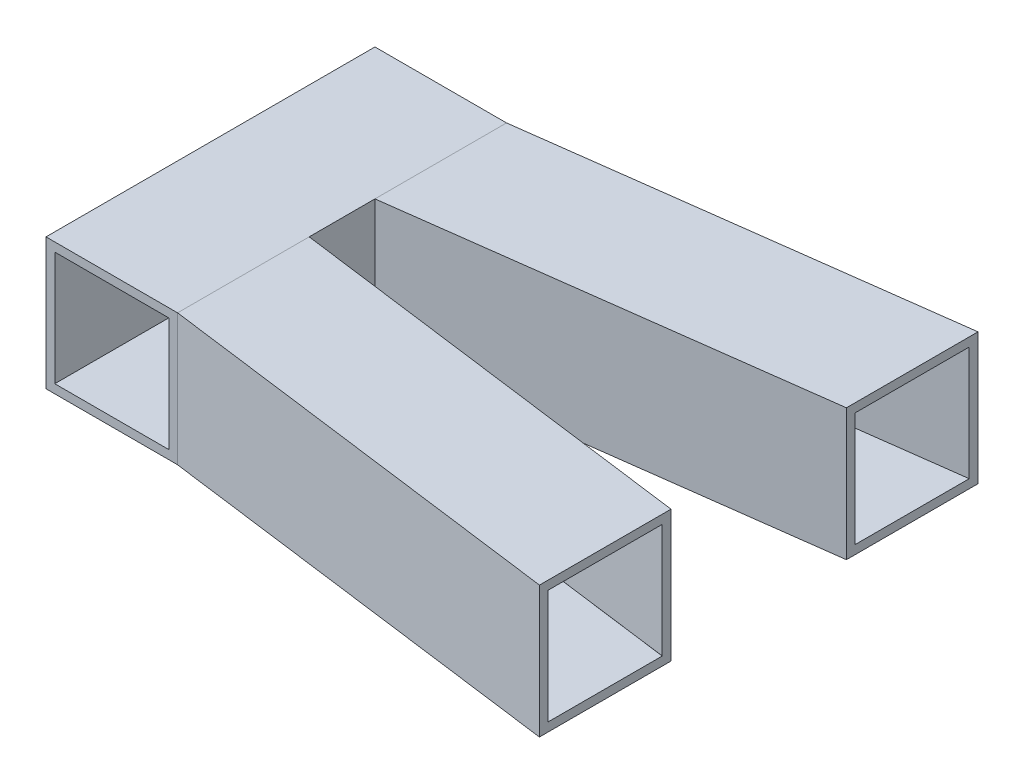
ISO-10303-21;
HEADER;
FILE_DESCRIPTION(('STEP AP214'),'2;1');
FILE_NAME('part.step','',(''),(''),'','','');
FILE_SCHEMA(('AUTOMOTIVE_DESIGN { 1 0 10303 214 1 1 1 1 }'));
ENDSEC;
DATA;
#1=APPLICATION_CONTEXT('core data for automotive mechanical design processes');
#2=APPLICATION_PROTOCOL_DEFINITION('international standard','automotive_design',2000,#1);
#3=PRODUCT_CONTEXT('',#1,'mechanical');
#4=PRODUCT('Part','Part','',(#3));
#5=PRODUCT_RELATED_PRODUCT_CATEGORY('part','',(#4));
#6=PRODUCT_DEFINITION_FORMATION('','',#4);
#7=PRODUCT_DEFINITION_CONTEXT('part definition',#1,'design');
#8=PRODUCT_DEFINITION('design','',#6,#7);
#9=PRODUCT_DEFINITION_SHAPE('','',#8);
#10=(LENGTH_UNIT() NAMED_UNIT(*) SI_UNIT(.MILLI.,.METRE.));
#11=(NAMED_UNIT(*) PLANE_ANGLE_UNIT() SI_UNIT($,.RADIAN.));
#12=(NAMED_UNIT(*) SI_UNIT($,.STERADIAN.) SOLID_ANGLE_UNIT());
#13=UNCERTAINTY_MEASURE_WITH_UNIT(LENGTH_MEASURE(1.E-05),#10,'distance_accuracy_value','');
#14=(GEOMETRIC_REPRESENTATION_CONTEXT(3) GLOBAL_UNCERTAINTY_ASSIGNED_CONTEXT((#13)) GLOBAL_UNIT_ASSIGNED_CONTEXT((#10,
#11,#12)) REPRESENTATION_CONTEXT('',''));
#15=CARTESIAN_POINT('',(0.,0.,0.));
#16=DIRECTION('',(0.,0.,1.));
#17=DIRECTION('',(1.,0.,0.));
#18=AXIS2_PLACEMENT_3D('',#15,#16,#17);
#19=CARTESIAN_POINT('',(-9.18992511912866,0.,-69.8434309053778));
#20=DIRECTION('',(-0.130454512571387,0.,-0.991454295542544));
#21=DIRECTION('',(-0.991454295542544,0.,0.130454512571387));
#22=AXIS2_PLACEMENT_3D('',#19,#20,#21);
#23=PLANE('',#22);
#24=DIRECTION('',(0.,-1.,0.));
#25=VECTOR('',#24,1.);
#26=CARTESIAN_POINT('',(30.,-30.,-75.));
#27=LINE('',#26,#25);
#28=CARTESIAN_POINT('',(30.,30.,-75.));
#29=VERTEX_POINT('',#28);
#30=CARTESIAN_POINT('',(30.,-30.,-75.));
#31=VERTEX_POINT('',#30);
#32=EDGE_CURVE('E75',#29,#31,#27,.T.);
#33=ORIENTED_EDGE('',*,*,#32,.T.);
#34=DIRECTION('',(0.991454295542544,0.,-0.130454512571387));
#35=VECTOR('',#34,1.);
#36=CARTESIAN_POINT('',(30.,-30.,-75.));
#37=LINE('',#36,#35);
#38=CARTESIAN_POINT('',(220.,-30.,-100.));
#39=VERTEX_POINT('',#38);
#40=EDGE_CURVE('E86',#31,#39,#37,.T.);
#41=ORIENTED_EDGE('',*,*,#40,.T.);
#42=DIRECTION('',(0.,1.,0.));
#43=VECTOR('',#42,1.);
#44=CARTESIAN_POINT('',(220.,-30.,-100.));
#45=LINE('',#44,#43);
#46=CARTESIAN_POINT('',(220.,30.,-100.));
#47=VERTEX_POINT('',#46);
#48=EDGE_CURVE('E71',#39,#47,#45,.T.);
#49=ORIENTED_EDGE('',*,*,#48,.T.);
#50=DIRECTION('',(-0.991454295542544,0.,0.130454512571387));
#51=VECTOR('',#50,1.);
#52=CARTESIAN_POINT('',(30.,30.,-75.));
#53=LINE('',#52,#51);
#54=EDGE_CURVE('E14',#47,#29,#53,.T.);
#55=ORIENTED_EDGE('',*,*,#54,.T.);
#56=EDGE_LOOP('',(#33,#41,#49,#55));
#57=FACE_BOUND('',#56,.T.);
#58=ADVANCED_FACE('F66',(#57),#23,.F.);
#59=OPEN_SHELL('',(#58));
#60=SHELL_BASED_SURFACE_MODEL('B2',(#59));
#61=CARTESIAN_POINT('',(-1.42954390742001,0.,-10.8645336963921));
#62=DIRECTION('',(0.130454512571387,0.,0.991454295542544));
#63=DIRECTION('',(0.991454295542544,0.,-0.130454512571387));
#64=AXIS2_PLACEMENT_3D('',#61,#62,#63);
#65=PLANE('',#64);
#66=DIRECTION('',(0.,1.,0.));
#67=VECTOR('',#66,1.);
#68=CARTESIAN_POINT('',(30.,30.,-15.));
#69=LINE('',#68,#67);
#70=CARTESIAN_POINT('',(30.,-30.,-15.));
#71=VERTEX_POINT('',#70);
#72=CARTESIAN_POINT('',(30.,30.,-15.));
#73=VERTEX_POINT('',#72);
#74=EDGE_CURVE('E129',#71,#73,#69,.T.);
#75=ORIENTED_EDGE('',*,*,#74,.T.);
#76=DIRECTION('',(0.991454295542544,0.,-0.130454512571387));
#77=VECTOR('',#76,1.);
#78=CARTESIAN_POINT('',(30.,30.,-15.));
#79=LINE('',#78,#77);
#80=CARTESIAN_POINT('',(220.,30.,-40.));
#81=VERTEX_POINT('',#80);
#82=EDGE_CURVE('E140',#73,#81,#79,.T.);
#83=ORIENTED_EDGE('',*,*,#82,.T.);
#84=DIRECTION('',(0.,-1.,0.));
#85=VECTOR('',#84,1.);
#86=CARTESIAN_POINT('',(220.,30.,-40.));
#87=LINE('',#86,#85);
#88=CARTESIAN_POINT('',(220.,-30.,-40.));
#89=VERTEX_POINT('',#88);
#90=EDGE_CURVE('E125',#81,#89,#87,.T.);
#91=ORIENTED_EDGE('',*,*,#90,.T.);
#92=DIRECTION('',(-0.991454295542544,0.,0.130454512571387));
#93=VECTOR('',#92,1.);
#94=CARTESIAN_POINT('',(30.,-30.,-15.));
#95=LINE('',#94,#93);
#96=EDGE_CURVE('E64',#89,#71,#95,.T.);
#97=ORIENTED_EDGE('',*,*,#96,.T.);
#98=EDGE_LOOP('',(#75,#83,#91,#97));
#99=FACE_BOUND('',#98,.T.);
#100=ADVANCED_FACE('F120',(#99),#65,.F.);
#101=OPEN_SHELL('',(#100));
#102=SHELL_BASED_SURFACE_MODEL('B8',(#101));
#103=CARTESIAN_POINT('',(0.,-30.,0.));
#104=DIRECTION('',(0.,-1.,0.));
#105=DIRECTION('',(0.,0.,-1.));
#106=AXIS2_PLACEMENT_3D('',#103,#104,#105);
#107=PLANE('',#106);
#108=DIRECTION('',(0.,0.,-1.));
#109=VECTOR('',#108,1.);
#110=CARTESIAN_POINT('',(30.,-30.,-15.));
#111=LINE('',#110,#109);
#112=CARTESIAN_POINT('',(30.,-30.,-15.));
#113=VERTEX_POINT('',#112);
#114=CARTESIAN_POINT('',(30.,-30.,-75.));
#115=VERTEX_POINT('',#114);
#116=EDGE_CURVE('E183',#113,#115,#111,.T.);
#117=ORIENTED_EDGE('',*,*,#116,.T.);
#118=DIRECTION('',(0.991454295542544,0.,-0.130454512571387));
#119=VECTOR('',#118,1.);
#120=CARTESIAN_POINT('',(30.,-30.,-75.));
#121=LINE('',#120,#119);
#122=CARTESIAN_POINT('',(220.,-30.,-100.));
#123=VERTEX_POINT('',#122);
#124=EDGE_CURVE('E194',#115,#123,#121,.T.);
#125=ORIENTED_EDGE('',*,*,#124,.T.);
#126=DIRECTION('',(0.,0.,1.));
#127=VECTOR('',#126,1.);
#128=CARTESIAN_POINT('',(220.,-30.,-100.));
#129=LINE('',#128,#127);
#130=CARTESIAN_POINT('',(220.,-30.,-40.));
#131=VERTEX_POINT('',#130);
#132=EDGE_CURVE('E179',#123,#131,#129,.T.);
#133=ORIENTED_EDGE('',*,*,#132,.T.);
#134=DIRECTION('',(-0.991454295542544,0.,0.130454512571387));
#135=VECTOR('',#134,1.);
#136=CARTESIAN_POINT('',(220.,-30.,-40.));
#137=LINE('',#136,#135);
#138=EDGE_CURVE('E118',#131,#113,#137,.T.);
#139=ORIENTED_EDGE('',*,*,#138,.T.);
#140=EDGE_LOOP('',(#117,#125,#133,#139));
#141=FACE_BOUND('',#140,.T.);
#142=ADVANCED_FACE('F174',(#141),#107,.T.);
#143=OPEN_SHELL('',(#142));
#144=SHELL_BASED_SURFACE_MODEL('B58',(#143));
#145=CARTESIAN_POINT('',(0.,30.,0.));
#146=DIRECTION('',(0.,-1.,0.));
#147=DIRECTION('',(0.,0.,-1.));
#148=AXIS2_PLACEMENT_3D('',#145,#146,#147);
#149=PLANE('',#148);
#150=DIRECTION('',(0.,0.,1.));
#151=VECTOR('',#150,1.);
#152=CARTESIAN_POINT('',(30.,30.,-15.));
#153=LINE('',#152,#151);
#154=CARTESIAN_POINT('',(30.,30.,-75.));
#155=VERTEX_POINT('',#154);
#156=CARTESIAN_POINT('',(30.,30.,-15.));
#157=VERTEX_POINT('',#156);
#158=EDGE_CURVE('E237',#155,#157,#153,.T.);
#159=ORIENTED_EDGE('',*,*,#158,.T.);
#160=DIRECTION('',(0.991454295542544,0.,-0.130454512571387));
#161=VECTOR('',#160,1.);
#162=CARTESIAN_POINT('',(220.,30.,-40.));
#163=LINE('',#162,#161);
#164=CARTESIAN_POINT('',(220.,30.,-40.));
#165=VERTEX_POINT('',#164);
#166=EDGE_CURVE('E248',#157,#165,#163,.T.);
#167=ORIENTED_EDGE('',*,*,#166,.T.);
#168=DIRECTION('',(0.,0.,-1.));
#169=VECTOR('',#168,1.);
#170=CARTESIAN_POINT('',(220.,30.,-100.));
#171=LINE('',#170,#169);
#172=CARTESIAN_POINT('',(220.,30.,-100.));
#173=VERTEX_POINT('',#172);
#174=EDGE_CURVE('E233',#165,#173,#171,.T.);
#175=ORIENTED_EDGE('',*,*,#174,.T.);
#176=DIRECTION('',(-0.991454295542544,0.,0.130454512571387));
#177=VECTOR('',#176,1.);
#178=CARTESIAN_POINT('',(30.,30.,-75.));
#179=LINE('',#178,#177);
#180=EDGE_CURVE('E172',#173,#155,#179,.T.);
#181=ORIENTED_EDGE('',*,*,#180,.T.);
#182=EDGE_LOOP('',(#159,#167,#175,#181));
#183=FACE_BOUND('',#182,.T.);
#184=ADVANCED_FACE('F228',(#183),#149,.F.);
#185=OPEN_SHELL('',(#184));
#186=SHELL_BASED_SURFACE_MODEL('B112',(#185));
#187=CARTESIAN_POINT('',(-8.67256637168142,0.,-65.9115044247788));
#188=DIRECTION('',(0.130454512571387,0.,0.991454295542544));
#189=DIRECTION('',(0.991454295542544,0.,-0.130454512571387));
#190=AXIS2_PLACEMENT_3D('',#187,#188,#189);
#191=PLANE('',#190);
#192=DIRECTION('',(-0.991454295542544,0.,0.130454512571387));
#193=VECTOR('',#192,1.);
#194=CARTESIAN_POINT('',(220.,-26.,-96.));
#195=LINE('',#194,#193);
#196=CARTESIAN_POINT('',(220.,-26.,-96.));
#197=VERTEX_POINT('',#196);
#198=CARTESIAN_POINT('',(30.,-26.,-71.));
#199=VERTEX_POINT('',#198);
#200=EDGE_CURVE('E341',#197,#199,#195,.T.);
#201=ORIENTED_EDGE('',*,*,#200,.T.);
#202=DIRECTION('',(0.,-1.,0.));
#203=VECTOR('',#202,1.);
#204=CARTESIAN_POINT('',(30.,26.,-71.));
#205=LINE('',#204,#203);
#206=CARTESIAN_POINT('',(30.,26.,-71.));
#207=VERTEX_POINT('',#206);
#208=EDGE_CURVE('E338',#207,#199,#205,.T.);
#209=ORIENTED_EDGE('',*,*,#208,.F.);
#210=DIRECTION('',(-0.991454295542544,0.,0.130454512571387));
#211=VECTOR('',#210,1.);
#212=CARTESIAN_POINT('',(220.,26.,-96.));
#213=LINE('',#212,#211);
#214=CARTESIAN_POINT('',(220.,26.,-96.));
#215=VERTEX_POINT('',#214);
#216=EDGE_CURVE('E330',#215,#207,#213,.T.);
#217=ORIENTED_EDGE('',*,*,#216,.F.);
#218=DIRECTION('',(0.,-1.,0.));
#219=VECTOR('',#218,1.);
#220=CARTESIAN_POINT('',(220.,26.,-96.));
#221=LINE('',#220,#219);
#222=EDGE_CURVE('E323',#215,#197,#221,.T.);
#223=ORIENTED_EDGE('',*,*,#222,.T.);
#224=EDGE_LOOP('',(#201,#209,#217,#223));
#225=FACE_BOUND('',#224,.T.);
#226=ADVANCED_FACE('F282',(#225),#191,.F.);
#227=CARTESIAN_POINT('',(0.,26.,0.));
#228=DIRECTION('',(0.,1.,0.));
#229=DIRECTION('',(-1.,0.,0.));
#230=AXIS2_PLACEMENT_3D('',#227,#228,#229);
#231=PLANE('',#230);
#232=ORIENTED_EDGE('',*,*,#216,.T.);
#233=DIRECTION('',(0.,0.,1.));
#234=VECTOR('',#233,1.);
#235=CARTESIAN_POINT('',(30.,26.,-71.));
#236=LINE('',#235,#234);
#237=CARTESIAN_POINT('',(30.,26.,-19.));
#238=VERTEX_POINT('',#237);
#239=EDGE_CURVE('E298',#207,#238,#236,.T.);
#240=ORIENTED_EDGE('',*,*,#239,.T.);
#241=DIRECTION('',(-0.991454295542544,0.,0.130454512571387));
#242=VECTOR('',#241,1.);
#243=CARTESIAN_POINT('',(220.,26.,-44.));
#244=LINE('',#243,#242);
#245=CARTESIAN_POINT('',(220.,26.,-44.));
#246=VERTEX_POINT('',#245);
#247=EDGE_CURVE('E285',#246,#238,#244,.T.);
#248=ORIENTED_EDGE('',*,*,#247,.F.);
#249=DIRECTION('',(0.,0.,-1.));
#250=VECTOR('',#249,1.);
#251=CARTESIAN_POINT('',(220.,26.,-96.));
#252=LINE('',#251,#250);
#253=EDGE_CURVE('E332',#246,#215,#252,.T.);
#254=ORIENTED_EDGE('',*,*,#253,.T.);
#255=EDGE_LOOP('',(#232,#240,#248,#254));
#256=FACE_BOUND('',#255,.T.);
#257=ADVANCED_FACE('F333',(#256),#231,.T.);
#258=CARTESIAN_POINT('',(0.,-26.,0.));
#259=DIRECTION('',(0.,1.,0.));
#260=DIRECTION('',(0.,0.,1.));
#261=AXIS2_PLACEMENT_3D('',#258,#259,#260);
#262=PLANE('',#261);
#263=DIRECTION('',(-0.991454295542544,0.,0.130454512571387));
#264=VECTOR('',#263,1.);
#265=CARTESIAN_POINT('',(220.,-26.,-44.));
#266=LINE('',#265,#264);
#267=CARTESIAN_POINT('',(220.,-26.,-44.));
#268=VERTEX_POINT('',#267);
#269=CARTESIAN_POINT('',(30.,-26.,-19.));
#270=VERTEX_POINT('',#269);
#271=EDGE_CURVE('E335',#268,#270,#266,.T.);
#272=ORIENTED_EDGE('',*,*,#271,.T.);
#273=DIRECTION('',(0.,0.,1.));
#274=VECTOR('',#273,1.);
#275=CARTESIAN_POINT('',(30.,-26.,-71.));
#276=LINE('',#275,#274);
#277=EDGE_CURVE('E350',#199,#270,#276,.T.);
#278=ORIENTED_EDGE('',*,*,#277,.F.);
#279=ORIENTED_EDGE('',*,*,#200,.F.);
#280=DIRECTION('',(0.,0.,1.));
#281=VECTOR('',#280,1.);
#282=CARTESIAN_POINT('',(220.,-26.,-96.));
#283=LINE('',#282,#281);
#284=EDGE_CURVE('E347',#197,#268,#283,.T.);
#285=ORIENTED_EDGE('',*,*,#284,.T.);
#286=EDGE_LOOP('',(#272,#278,#279,#285));
#287=FACE_BOUND('',#286,.T.);
#288=ADVANCED_FACE('F359',(#287),#262,.F.);
#289=CARTESIAN_POINT('',(-1.94690265486726,0.,-14.7964601769912));
#290=DIRECTION('',(0.130454512571387,0.,0.991454295542544));
#291=DIRECTION('',(0.991454295542544,0.,-0.130454512571387));
#292=AXIS2_PLACEMENT_3D('',#289,#290,#291);
#293=PLANE('',#292);
#294=ORIENTED_EDGE('',*,*,#247,.T.);
#295=DIRECTION('',(0.,-1.,0.));
#296=VECTOR('',#295,1.);
#297=CARTESIAN_POINT('',(30.,26.,-19.));
#298=LINE('',#297,#296);
#299=EDGE_CURVE('E290',#238,#270,#298,.T.);
#300=ORIENTED_EDGE('',*,*,#299,.T.);
#301=ORIENTED_EDGE('',*,*,#271,.F.);
#302=DIRECTION('',(0.,1.,0.));
#303=VECTOR('',#302,1.);
#304=CARTESIAN_POINT('',(220.,26.,-44.));
#305=LINE('',#304,#303);
#306=EDGE_CURVE('E226',#268,#246,#305,.T.);
#307=ORIENTED_EDGE('',*,*,#306,.T.);
#308=EDGE_LOOP('',(#294,#300,#301,#307));
#309=FACE_BOUND('',#308,.T.);
#310=ADVANCED_FACE('F283',(#309),#293,.T.);
#311=OPEN_SHELL('',(#226,#257,#288,#310));
#312=SHELL_BASED_SURFACE_MODEL('B166',(#311));
#313=CARTESIAN_POINT('',(-0.00502169640073844,-29.9949766218739,0.));
#314=DIRECTION('',(0.000167417911127839,0.999999985985621,0.));
#315=DIRECTION('',(-0.999999985985622,0.000167417911127839,0.));
#316=AXIS2_PLACEMENT_3D('',#313,#314,#315);
#317=PLANE('',#316);
#318=DIRECTION('',(-0.991454281884392,0.000165987207178044,-0.130454510774262));
#319=VECTOR('',#318,1.);
#320=CARTESIAN_POINT('',(30.,-30.,75.));
#321=LINE('',#320,#319);
#322=CARTESIAN_POINT('',(220.,-30.0318094035601,100.));
#323=VERTEX_POINT('',#322);
#324=CARTESIAN_POINT('',(30.,-30.,75.));
#325=VERTEX_POINT('',#324);
#326=EDGE_CURVE('E426',#323,#325,#321,.T.);
#327=ORIENTED_EDGE('',*,*,#326,.T.);
#328=DIRECTION('',(0.,0.,-1.));
#329=VECTOR('',#328,1.);
#330=CARTESIAN_POINT('',(30.,-30.,15.));
#331=LINE('',#330,#329);
#332=CARTESIAN_POINT('',(30.,-30.,15.));
#333=VERTEX_POINT('',#332);
#334=EDGE_CURVE('E437',#325,#333,#331,.T.);
#335=ORIENTED_EDGE('',*,*,#334,.T.);
#336=DIRECTION('',(0.991454281884392,-0.000165987207178044,0.130454510774262));
#337=VECTOR('',#336,1.);
#338=CARTESIAN_POINT('',(220.,-30.0318094035601,40.));
#339=LINE('',#338,#337);
#340=CARTESIAN_POINT('',(220.,-30.0318094035601,40.));
#341=VERTEX_POINT('',#340);
#342=EDGE_CURVE('E422',#333,#341,#339,.T.);
#343=ORIENTED_EDGE('',*,*,#342,.T.);
#344=DIRECTION('',(0.,0.,1.));
#345=VECTOR('',#344,1.);
#346=CARTESIAN_POINT('',(220.,-30.0318094035601,100.));
#347=LINE('',#346,#345);
#348=EDGE_CURVE('E280',#341,#323,#347,.T.);
#349=ORIENTED_EDGE('',*,*,#348,.T.);
#350=EDGE_LOOP('',(#327,#335,#343,#349));
#351=FACE_BOUND('',#350,.T.);
#352=ADVANCED_FACE('F417',(#351),#317,.F.);
#353=OPEN_SHELL('',(#352));
#354=SHELL_BASED_SURFACE_MODEL('B220',(#353));
#355=CARTESIAN_POINT('',(-9.18992511912866,0.,69.8434309053778));
#356=DIRECTION('',(-0.130454512571387,0.,0.991454295542544));
#357=DIRECTION('',(0.991454295542544,0.,0.130454512571387));
#358=AXIS2_PLACEMENT_3D('',#355,#356,#357);
#359=PLANE('',#358);
#360=DIRECTION('',(0.,-1.,0.));
#361=VECTOR('',#360,1.);
#362=CARTESIAN_POINT('',(30.,30.,75.));
#363=LINE('',#362,#361);
#364=CARTESIAN_POINT('',(30.,30.,75.));
#365=VERTEX_POINT('',#364);
#366=CARTESIAN_POINT('',(30.,-30.0318094035601,75.));
#367=VERTEX_POINT('',#366);
#368=EDGE_CURVE('E479',#365,#367,#363,.T.);
#369=ORIENTED_EDGE('',*,*,#368,.T.);
#370=DIRECTION('',(0.991454295542544,0.,0.130454512571387));
#371=VECTOR('',#370,1.);
#372=CARTESIAN_POINT('',(30.,-30.0318094035601,75.));
#373=LINE('',#372,#371);
#374=CARTESIAN_POINT('',(220.,-30.0318094035601,100.));
#375=VERTEX_POINT('',#374);
#376=EDGE_CURVE('E490',#367,#375,#373,.T.);
#377=ORIENTED_EDGE('',*,*,#376,.T.);
#378=DIRECTION('',(0.,1.,0.));
#379=VECTOR('',#378,1.);
#380=CARTESIAN_POINT('',(220.,30.,100.));
#381=LINE('',#380,#379);
#382=CARTESIAN_POINT('',(220.,30.,100.));
#383=VERTEX_POINT('',#382);
#384=EDGE_CURVE('E475',#375,#383,#381,.T.);
#385=ORIENTED_EDGE('',*,*,#384,.T.);
#386=DIRECTION('',(-0.991454295542544,0.,-0.130454512571387));
#387=VECTOR('',#386,1.);
#388=CARTESIAN_POINT('',(30.,30.,75.));
#389=LINE('',#388,#387);
#390=EDGE_CURVE('E415',#383,#365,#389,.T.);
#391=ORIENTED_EDGE('',*,*,#390,.T.);
#392=EDGE_LOOP('',(#369,#377,#385,#391));
#393=FACE_BOUND('',#392,.T.);
#394=ADVANCED_FACE('F470',(#393),#359,.T.);
#395=OPEN_SHELL('',(#394));
#396=SHELL_BASED_SURFACE_MODEL('B274',(#395));
#397=CARTESIAN_POINT('',(0.00502337812615642,30.0050216964007,0.));
#398=DIRECTION('',(-0.000167417911127839,-0.999999985985621,0.));
#399=DIRECTION('',(0.999999985985622,-0.000167417911127839,0.));
#400=AXIS2_PLACEMENT_3D('',#397,#398,#399);
#401=PLANE('',#400);
#402=DIRECTION('',(0.,0.,-1.));
#403=VECTOR('',#402,1.);
#404=CARTESIAN_POINT('',(30.,30.,75.));
#405=LINE('',#404,#403);
#406=CARTESIAN_POINT('',(30.,30.,75.));
#407=VERTEX_POINT('',#406);
#408=CARTESIAN_POINT('',(30.,30.,15.));
#409=VERTEX_POINT('',#408);
#410=EDGE_CURVE('E532',#407,#409,#405,.T.);
#411=ORIENTED_EDGE('',*,*,#410,.T.);
#412=DIRECTION('',(0.991454281884392,-0.000165987207178044,0.130454510774262));
#413=VECTOR('',#412,1.);
#414=CARTESIAN_POINT('',(30.,30.,15.));
#415=LINE('',#414,#413);
#416=CARTESIAN_POINT('',(220.,29.9681905964399,40.));
#417=VERTEX_POINT('',#416);
#418=EDGE_CURVE('E543',#409,#417,#415,.T.);
#419=ORIENTED_EDGE('',*,*,#418,.T.);
#420=DIRECTION('',(0.,0.,1.));
#421=VECTOR('',#420,1.);
#422=CARTESIAN_POINT('',(220.,29.9681905964399,40.));
#423=LINE('',#422,#421);
#424=CARTESIAN_POINT('',(220.,29.9681905964399,100.));
#425=VERTEX_POINT('',#424);
#426=EDGE_CURVE('E528',#417,#425,#423,.T.);
#427=ORIENTED_EDGE('',*,*,#426,.T.);
#428=DIRECTION('',(-0.991454281884392,0.000165987207178044,-0.130454510774262));
#429=VECTOR('',#428,1.);
#430=CARTESIAN_POINT('',(220.,29.9681905964399,100.));
#431=LINE('',#430,#429);
#432=EDGE_CURVE('E468',#425,#407,#431,.T.);
#433=ORIENTED_EDGE('',*,*,#432,.T.);
#434=EDGE_LOOP('',(#411,#419,#427,#433));
#435=FACE_BOUND('',#434,.T.);
#436=ADVANCED_FACE('F523',(#435),#401,.T.);
#437=OPEN_SHELL('',(#436));
#438=SHELL_BASED_SURFACE_MODEL('B409',(#437));
#439=CARTESIAN_POINT('',(-0.00435202476561199,-25.9949767339889,0.));
#440=DIRECTION('',(0.000167417911127834,0.999999985985621,0.));
#441=DIRECTION('',(-0.999999985985621,0.000167417911127834,0.));
#442=AXIS2_PLACEMENT_3D('',#439,#440,#441);
#443=PLANE('',#442);
#444=DIRECTION('',(0.00016741790643521,-2.80287566068544E-08,-0.999999985985622));
#445=VECTOR('',#444,1.);
#446=CARTESIAN_POINT('',(30.,-26.,19.));
#447=LINE('',#446,#445);
#448=CARTESIAN_POINT('',(29.9912942687434,-25.9999985425046,71.));
#449=VERTEX_POINT('',#448);
#450=CARTESIAN_POINT('',(30.,-26.,19.));
#451=VERTEX_POINT('',#450);
#452=EDGE_CURVE('E585',#449,#451,#447,.T.);
#453=ORIENTED_EDGE('',*,*,#452,.T.);
#454=DIRECTION('',(0.991454281884392,-0.000165987207178044,0.130454510774262));
#455=VECTOR('',#454,1.);
#456=CARTESIAN_POINT('',(220.,-26.0318094035601,44.));
#457=LINE('',#456,#455);
#458=CARTESIAN_POINT('',(220.,-26.0318094035601,44.));
#459=VERTEX_POINT('',#458);
#460=EDGE_CURVE('E596',#451,#459,#457,.T.);
#461=ORIENTED_EDGE('',*,*,#460,.T.);
#462=DIRECTION('',(0.,0.,1.));
#463=VECTOR('',#462,1.);
#464=CARTESIAN_POINT('',(220.,-26.0318094035601,96.));
#465=LINE('',#464,#463);
#466=CARTESIAN_POINT('',(220.,-26.0318094035601,96.));
#467=VERTEX_POINT('',#466);
#468=EDGE_CURVE('E581',#459,#467,#465,.T.);
#469=ORIENTED_EDGE('',*,*,#468,.T.);
#470=DIRECTION('',(-0.991455054944404,0.000165987336602129,-0.130448635383409));
#471=VECTOR('',#470,1.);
#472=CARTESIAN_POINT('',(29.9912942687434,-25.9999985425046,71.));
#473=LINE('',#472,#471);
#474=EDGE_CURVE('E521',#467,#449,#473,.T.);
#475=ORIENTED_EDGE('',*,*,#474,.T.);
#476=EDGE_LOOP('',(#453,#461,#469,#475));
#477=FACE_BOUND('',#476,.T.);
#478=ADVANCED_FACE('F576',(#477),#443,.F.);
#479=OPEN_SHELL('',(#478));
#480=SHELL_BASED_SURFACE_MODEL('B462',(#479));
#481=CARTESIAN_POINT('',(-8.67256637168142,0.,65.9115044247788));
#482=DIRECTION('',(-0.130454512571387,0.,0.991454295542544));
#483=DIRECTION('',(0.991454295542544,0.,0.130454512571387));
#484=AXIS2_PLACEMENT_3D('',#481,#482,#483);
#485=PLANE('',#484);
#486=DIRECTION('',(0.,-1.,0.));
#487=VECTOR('',#486,1.);
#488=CARTESIAN_POINT('',(30.,26.,71.));
#489=LINE('',#488,#487);
#490=CARTESIAN_POINT('',(30.,26.,71.));
#491=VERTEX_POINT('',#490);
#492=CARTESIAN_POINT('',(30.,-26.0318094035601,71.));
#493=VERTEX_POINT('',#492);
#494=EDGE_CURVE('E638',#491,#493,#489,.T.);
#495=ORIENTED_EDGE('',*,*,#494,.T.);
#496=DIRECTION('',(0.991454295542544,0.,0.130454512571387));
#497=VECTOR('',#496,1.);
#498=CARTESIAN_POINT('',(30.,-26.0318094035601,71.));
#499=LINE('',#498,#497);
#500=CARTESIAN_POINT('',(220.,-26.0318094035601,96.));
#501=VERTEX_POINT('',#500);
#502=EDGE_CURVE('E649',#493,#501,#499,.T.);
#503=ORIENTED_EDGE('',*,*,#502,.T.);
#504=DIRECTION('',(0.,1.,0.));
#505=VECTOR('',#504,1.);
#506=CARTESIAN_POINT('',(220.,26.,96.));
#507=LINE('',#506,#505);
#508=CARTESIAN_POINT('',(220.,26.,96.));
#509=VERTEX_POINT('',#508);
#510=EDGE_CURVE('E634',#501,#509,#507,.T.);
#511=ORIENTED_EDGE('',*,*,#510,.T.);
#512=DIRECTION('',(-0.991454295542544,0.,-0.130454512571387));
#513=VECTOR('',#512,1.);
#514=CARTESIAN_POINT('',(30.,26.,71.));
#515=LINE('',#514,#513);
#516=EDGE_CURVE('E574',#509,#491,#515,.T.);
#517=ORIENTED_EDGE('',*,*,#516,.T.);
#518=EDGE_LOOP('',(#495,#503,#511,#517));
#519=FACE_BOUND('',#518,.T.);
#520=ADVANCED_FACE('F629',(#519),#485,.T.);
#521=OPEN_SHELL('',(#520));
#522=SHELL_BASED_SURFACE_MODEL('B515',(#521));
#523=CARTESIAN_POINT('',(0.0043537064910301,26.0050218085158,0.));
#524=DIRECTION('',(-0.000167417911127839,-0.999999985985621,0.));
#525=DIRECTION('',(0.999999985985622,-0.000167417911127839,0.));
#526=AXIS2_PLACEMENT_3D('',#523,#524,#525);
#527=PLANE('',#526);
#528=DIRECTION('',(0.,0.,-1.));
#529=VECTOR('',#528,1.);
#530=CARTESIAN_POINT('',(30.,26.,71.));
#531=LINE('',#530,#529);
#532=CARTESIAN_POINT('',(30.,26.,71.));
#533=VERTEX_POINT('',#532);
#534=CARTESIAN_POINT('',(30.,26.,19.));
#535=VERTEX_POINT('',#534);
#536=EDGE_CURVE('E691',#533,#535,#531,.T.);
#537=ORIENTED_EDGE('',*,*,#536,.T.);
#538=DIRECTION('',(0.991454281884392,-0.000165987207178044,0.130454510774262));
#539=VECTOR('',#538,1.);
#540=CARTESIAN_POINT('',(30.,26.,19.));
#541=LINE('',#540,#539);
#542=CARTESIAN_POINT('',(220.,25.9681905964399,44.));
#543=VERTEX_POINT('',#542);
#544=EDGE_CURVE('E702',#535,#543,#541,.T.);
#545=ORIENTED_EDGE('',*,*,#544,.T.);
#546=DIRECTION('',(0.,0.,1.));
#547=VECTOR('',#546,1.);
#548=CARTESIAN_POINT('',(220.,25.9681905964399,44.));
#549=LINE('',#548,#547);
#550=CARTESIAN_POINT('',(220.,25.9681905964399,96.));
#551=VERTEX_POINT('',#550);
#552=EDGE_CURVE('E687',#543,#551,#549,.T.);
#553=ORIENTED_EDGE('',*,*,#552,.T.);
#554=DIRECTION('',(-0.991454281884392,0.000165987207178044,-0.130454510774262));
#555=VECTOR('',#554,1.);
#556=CARTESIAN_POINT('',(220.,25.9681905964399,96.));
#557=LINE('',#556,#555);
#558=EDGE_CURVE('E627',#551,#533,#557,.T.);
#559=ORIENTED_EDGE('',*,*,#558,.T.);
#560=EDGE_LOOP('',(#537,#545,#553,#559));
#561=FACE_BOUND('',#560,.T.);
#562=ADVANCED_FACE('F682',(#561),#527,.T.);
#563=OPEN_SHELL('',(#562));
#564=SHELL_BASED_SURFACE_MODEL('B568',(#563));
#565=CARTESIAN_POINT('',(-1.94690265486726,0.,14.7964601769912));
#566=DIRECTION('',(0.130454512571387,0.,-0.991454295542544));
#567=DIRECTION('',(-0.991454295542544,0.,-0.130454512571387));
#568=AXIS2_PLACEMENT_3D('',#565,#566,#567);
#569=PLANE('',#568);
#570=DIRECTION('',(0.,-1.,0.));
#571=VECTOR('',#570,1.);
#572=CARTESIAN_POINT('',(220.,25.9681905964399,44.));
#573=LINE('',#572,#571);
#574=CARTESIAN_POINT('',(220.,25.9681905964399,44.));
#575=VERTEX_POINT('',#574);
#576=CARTESIAN_POINT('',(220.,-26.,44.));
#577=VERTEX_POINT('',#576);
#578=EDGE_CURVE('E744',#575,#577,#573,.T.);
#579=ORIENTED_EDGE('',*,*,#578,.T.);
#580=DIRECTION('',(-0.991454295542544,0.,-0.130454512571387));
#581=VECTOR('',#580,1.);
#582=CARTESIAN_POINT('',(220.,-26.,44.));
#583=LINE('',#582,#581);
#584=CARTESIAN_POINT('',(30.,-26.,19.));
#585=VERTEX_POINT('',#584);
#586=EDGE_CURVE('E755',#577,#585,#583,.T.);
#587=ORIENTED_EDGE('',*,*,#586,.T.);
#588=DIRECTION('',(0.,1.,0.));
#589=VECTOR('',#588,1.);
#590=CARTESIAN_POINT('',(30.,25.9681905964399,19.));
#591=LINE('',#590,#589);
#592=CARTESIAN_POINT('',(30.,25.9681905964399,19.));
#593=VERTEX_POINT('',#592);
#594=EDGE_CURVE('E740',#585,#593,#591,.T.);
#595=ORIENTED_EDGE('',*,*,#594,.T.);
#596=DIRECTION('',(0.991454295542544,0.,0.130454512571387));
#597=VECTOR('',#596,1.);
#598=CARTESIAN_POINT('',(220.,25.9681905964399,44.));
#599=LINE('',#598,#597);
#600=EDGE_CURVE('E680',#593,#575,#599,.T.);
#601=ORIENTED_EDGE('',*,*,#600,.T.);
#602=EDGE_LOOP('',(#579,#587,#595,#601));
#603=FACE_BOUND('',#602,.T.);
#604=ADVANCED_FACE('F735',(#603),#569,.T.);
#605=OPEN_SHELL('',(#604));
#606=SHELL_BASED_SURFACE_MODEL('B621',(#605));
#607=CARTESIAN_POINT('',(30.0000000000001,-30.,15.));
#608=CARTESIAN_POINT('',(30.0000000000001,-10.01060313452,15.));
#609=CARTESIAN_POINT('',(30.0000000000001,9.97879373095995,15.));
#610=CARTESIAN_POINT('',(30.0000000000001,29.9681905964399,15.));
#611=CARTESIAN_POINT('',(93.3333333333334,-30.,23.3333333333333));
#612=CARTESIAN_POINT('',(93.3333333333334,-10.01060313452,23.3333333333333));
#613=CARTESIAN_POINT('',(93.3333333333334,9.97879373095995,23.3333333333333));
#614=CARTESIAN_POINT('',(93.3333333333334,29.9681905964399,23.3333333333333));
#615=CARTESIAN_POINT('',(156.666666666667,-30.,31.6666666666667));
#616=CARTESIAN_POINT('',(156.666666666667,-10.01060313452,31.6666666666667));
#617=CARTESIAN_POINT('',(156.666666666667,9.97879373095995,31.6666666666667));
#618=CARTESIAN_POINT('',(156.666666666667,29.9681905964399,31.6666666666667));
#619=CARTESIAN_POINT('',(220.,-30.,40.));
#620=CARTESIAN_POINT('',(220.,-10.01060313452,40.));
#621=CARTESIAN_POINT('',(220.,9.97879373095995,40.));
#622=CARTESIAN_POINT('',(220.,29.9681905964399,40.));
#623=B_SPLINE_SURFACE_WITH_KNOTS('',3,3,((#607,#608,#609,#610),(#611,#612,#613,#614),(#615,#616,
#617,#618),(#619,#620,#621,#622)),.UNSPECIFIED.,.F.,.F.,.F.,(4,4),(4,4),(0.,1.),(0.,1.),.UNSPECIFIED.);
#624=CARTESIAN_POINT('',(30.0000000000001,-30.,15.));
#625=CARTESIAN_POINT('',(93.3333333333334,-30.,23.3333333333333));
#626=CARTESIAN_POINT('',(156.666666666667,-30.,31.6666666666667));
#627=CARTESIAN_POINT('',(220.,-30.,40.));
#628=B_SPLINE_CURVE_WITH_KNOTS('',3,(#624,#625,#626,#627),.UNSPECIFIED.,.F.,.F.,(4,4),(0.,1.),.UNSPECIFIED.);
#629=CARTESIAN_POINT('',(30.0000000000001,-30.,15.));
#630=VERTEX_POINT('',#629);
#631=CARTESIAN_POINT('',(220.,-30.,40.));
#632=VERTEX_POINT('',#631);
#633=EDGE_CURVE('E733',#630,#632,#628,.T.);
#634=CARTESIAN_POINT('',(220.,-30.,40.));
#635=CARTESIAN_POINT('',(220.,-10.01060313452,40.));
#636=CARTESIAN_POINT('',(220.,9.97879373095995,40.));
#637=CARTESIAN_POINT('',(220.,29.9681905964399,40.));
#638=B_SPLINE_CURVE_WITH_KNOTS('',3,(#634,#635,#636,#637),.UNSPECIFIED.,.F.,.F.,(4,4),(0.,1.),.UNSPECIFIED.);
#639=CARTESIAN_POINT('',(220.,29.9681905964399,40.));
#640=VERTEX_POINT('',#639);
#641=EDGE_CURVE('E799',#632,#640,#638,.T.);
#642=CARTESIAN_POINT('',(30.0000000000001,29.9681905964399,15.));
#643=CARTESIAN_POINT('',(93.3333333333334,29.9681905964399,23.3333333333333));
#644=CARTESIAN_POINT('',(156.666666666667,29.9681905964399,31.6666666666667));
#645=CARTESIAN_POINT('',(220.,29.9681905964399,40.));
#646=B_SPLINE_CURVE_WITH_KNOTS('',3,(#642,#643,#644,#645),.UNSPECIFIED.,.F.,.F.,(4,4),(0.,1.),.UNSPECIFIED.);
#647=CARTESIAN_POINT('',(30.0000000000001,29.9681905964399,15.));
#648=VERTEX_POINT('',#647);
#649=EDGE_CURVE('E807',#640,#648,#646,.F.);
#650=CARTESIAN_POINT('',(30.0000000000001,-30.,15.));
#651=CARTESIAN_POINT('',(30.0000000000001,-10.01060313452,15.));
#652=CARTESIAN_POINT('',(30.0000000000001,9.97879373095995,15.));
#653=CARTESIAN_POINT('',(30.0000000000001,29.9681905964399,15.));
#654=B_SPLINE_CURVE_WITH_KNOTS('',3,(#650,#651,#652,#653),.UNSPECIFIED.,.F.,.F.,(4,4),(0.,1.),.UNSPECIFIED.);
#655=EDGE_CURVE('E791',#648,#630,#654,.F.);
#656=ORIENTED_EDGE('',*,*,#633,.T.);
#657=ORIENTED_EDGE('',*,*,#641,.T.);
#658=ORIENTED_EDGE('',*,*,#649,.T.);
#659=ORIENTED_EDGE('',*,*,#655,.T.);
#660=EDGE_LOOP('',(#656,#657,#658,#659));
#661=FACE_BOUND('',#660,.T.);
#662=ADVANCED_FACE('F788',(#661),#623,.T.);
#663=OPEN_SHELL('',(#662));
#664=SHELL_BASED_SURFACE_MODEL('B674',(#663));
#665=CARTESIAN_POINT('',(220.,0.,0.));
#666=DIRECTION('',(-1.,0.,0.));
#667=DIRECTION('',(0.,0.,1.));
#668=AXIS2_PLACEMENT_3D('',#665,#666,#667);
#669=PLANE('',#668);
#670=DIRECTION('',(0.,1.,0.));
#671=VECTOR('',#670,1.);
#672=CARTESIAN_POINT('',(220.,30.,-100.));
#673=LINE('',#672,#671);
#674=CARTESIAN_POINT('',(220.,-30.,-100.));
#675=VERTEX_POINT('',#674);
#676=CARTESIAN_POINT('',(220.,30.,-100.));
#677=VERTEX_POINT('',#676);
#678=EDGE_CURVE('E901',#675,#677,#673,.T.);
#679=ORIENTED_EDGE('',*,*,#678,.T.);
#680=DIRECTION('',(0.,0.,1.));
#681=VECTOR('',#680,1.);
#682=CARTESIAN_POINT('',(220.,30.,-100.));
#683=LINE('',#682,#681);
#684=CARTESIAN_POINT('',(220.,30.,-40.));
#685=VERTEX_POINT('',#684);
#686=EDGE_CURVE('E903',#677,#685,#683,.T.);
#687=ORIENTED_EDGE('',*,*,#686,.T.);
#688=DIRECTION('',(0.,-1.,0.));
#689=VECTOR('',#688,1.);
#690=CARTESIAN_POINT('',(220.,30.,-40.));
#691=LINE('',#690,#689);
#692=CARTESIAN_POINT('',(220.,-30.,-40.));
#693=VERTEX_POINT('',#692);
#694=EDGE_CURVE('E910',#685,#693,#691,.T.);
#695=ORIENTED_EDGE('',*,*,#694,.T.);
#696=DIRECTION('',(0.,0.,-1.));
#697=VECTOR('',#696,1.);
#698=CARTESIAN_POINT('',(220.,-30.,-100.));
#699=LINE('',#698,#697);
#700=EDGE_CURVE('E906',#693,#675,#699,.T.);
#701=ORIENTED_EDGE('',*,*,#700,.T.);
#702=EDGE_LOOP('',(#679,#687,#695,#701));
#703=FACE_BOUND('',#702,.T.);
#704=DIRECTION('',(0.,1.,0.));
#705=VECTOR('',#704,1.);
#706=CARTESIAN_POINT('',(220.,26.,-96.));
#707=LINE('',#706,#705);
#708=CARTESIAN_POINT('',(220.,-26.,-96.));
#709=VERTEX_POINT('',#708);
#710=CARTESIAN_POINT('',(220.,26.,-96.));
#711=VERTEX_POINT('',#710);
#712=EDGE_CURVE('E877',#709,#711,#707,.T.);
#713=ORIENTED_EDGE('',*,*,#712,.F.);
#714=DIRECTION('',(0.,0.,-1.));
#715=VECTOR('',#714,1.);
#716=CARTESIAN_POINT('',(220.,-26.,-96.));
#717=LINE('',#716,#715);
#718=CARTESIAN_POINT('',(220.,-26.,-44.));
#719=VERTEX_POINT('',#718);
#720=EDGE_CURVE('E921',#719,#709,#717,.T.);
#721=ORIENTED_EDGE('',*,*,#720,.F.);
#722=DIRECTION('',(0.,-1.,0.));
#723=VECTOR('',#722,1.);
#724=CARTESIAN_POINT('',(220.,26.,-44.));
#725=LINE('',#724,#723);
#726=CARTESIAN_POINT('',(220.,26.,-44.));
#727=VERTEX_POINT('',#726);
#728=EDGE_CURVE('E873',#727,#719,#725,.T.);
#729=ORIENTED_EDGE('',*,*,#728,.F.);
#730=DIRECTION('',(0.,0.,1.));
#731=VECTOR('',#730,1.);
#732=CARTESIAN_POINT('',(220.,26.,-96.));
#733=LINE('',#732,#731);
#734=EDGE_CURVE('E786',#711,#727,#733,.T.);
#735=ORIENTED_EDGE('',*,*,#734,.F.);
#736=EDGE_LOOP('',(#713,#721,#729,#735));
#737=FACE_BOUND('',#736,.T.);
#738=ADVANCED_FACE('F868',(#703,#737),#669,.F.);
#739=OPEN_SHELL('',(#738));
#740=SHELL_BASED_SURFACE_MODEL('B727',(#739));
#741=CARTESIAN_POINT('',(220.,0.,0.));
#742=DIRECTION('',(1.,0.,0.));
#743=DIRECTION('',(0.,0.,-1.));
#744=AXIS2_PLACEMENT_3D('',#741,#742,#743);
#745=PLANE('',#744);
#746=DIRECTION('',(0.,-1.,0.));
#747=VECTOR('',#746,1.);
#748=CARTESIAN_POINT('',(220.,25.9681905964399,96.));
#749=LINE('',#748,#747);
#750=CARTESIAN_POINT('',(220.,25.9681905964399,96.));
#751=VERTEX_POINT('',#750);
#752=CARTESIAN_POINT('',(220.,-26.0318094035601,96.));
#753=VERTEX_POINT('',#752);
#754=EDGE_CURVE('E990',#751,#753,#749,.T.);
#755=ORIENTED_EDGE('',*,*,#754,.F.);
#756=DIRECTION('',(0.,0.,1.));
#757=VECTOR('',#756,1.);
#758=CARTESIAN_POINT('',(220.,25.9681905964399,96.));
#759=LINE('',#758,#757);
#760=CARTESIAN_POINT('',(220.,25.9681905964399,44.));
#761=VERTEX_POINT('',#760);
#762=EDGE_CURVE('E992',#761,#751,#759,.T.);
#763=ORIENTED_EDGE('',*,*,#762,.F.);
#764=DIRECTION('',(0.,1.,0.));
#765=VECTOR('',#764,1.);
#766=CARTESIAN_POINT('',(220.,25.9681905964399,44.));
#767=LINE('',#766,#765);
#768=CARTESIAN_POINT('',(220.,-26.0318094035601,44.));
#769=VERTEX_POINT('',#768);
#770=EDGE_CURVE('E999',#769,#761,#767,.T.);
#771=ORIENTED_EDGE('',*,*,#770,.F.);
#772=DIRECTION('',(0.,0.,-1.));
#773=VECTOR('',#772,1.);
#774=CARTESIAN_POINT('',(220.,-26.0318094035601,96.));
#775=LINE('',#774,#773);
#776=EDGE_CURVE('E995',#753,#769,#775,.T.);
#777=ORIENTED_EDGE('',*,*,#776,.F.);
#778=EDGE_LOOP('',(#755,#763,#771,#777));
#779=FACE_BOUND('',#778,.T.);
#780=DIRECTION('',(0.,-1.,0.));
#781=VECTOR('',#780,1.);
#782=CARTESIAN_POINT('',(220.,29.9681905964399,100.));
#783=LINE('',#782,#781);
#784=CARTESIAN_POINT('',(220.,29.9681905964399,100.));
#785=VERTEX_POINT('',#784);
#786=CARTESIAN_POINT('',(220.,-30.0318094035601,100.));
#787=VERTEX_POINT('',#786);
#788=EDGE_CURVE('E966',#785,#787,#783,.T.);
#789=ORIENTED_EDGE('',*,*,#788,.T.);
#790=DIRECTION('',(0.,0.,-1.));
#791=VECTOR('',#790,1.);
#792=CARTESIAN_POINT('',(220.,-30.0318094035601,100.));
#793=LINE('',#792,#791);
#794=CARTESIAN_POINT('',(220.,-30.0318094035601,40.));
#795=VERTEX_POINT('',#794);
#796=EDGE_CURVE('E1010',#787,#795,#793,.T.);
#797=ORIENTED_EDGE('',*,*,#796,.T.);
#798=DIRECTION('',(0.,1.,0.));
#799=VECTOR('',#798,1.);
#800=CARTESIAN_POINT('',(220.,29.9681905964399,40.));
#801=LINE('',#800,#799);
#802=CARTESIAN_POINT('',(220.,29.9681905964399,40.));
#803=VERTEX_POINT('',#802);
#804=EDGE_CURVE('E962',#795,#803,#801,.T.);
#805=ORIENTED_EDGE('',*,*,#804,.T.);
#806=DIRECTION('',(0.,0.,1.));
#807=VECTOR('',#806,1.);
#808=CARTESIAN_POINT('',(220.,29.9681905964399,100.));
#809=LINE('',#808,#807);
#810=EDGE_CURVE('E866',#803,#785,#809,.T.);
#811=ORIENTED_EDGE('',*,*,#810,.T.);
#812=EDGE_LOOP('',(#789,#797,#805,#811));
#813=FACE_BOUND('',#812,.T.);
#814=ADVANCED_FACE('F957',(#779,#813),#745,.T.);
#815=OPEN_SHELL('',(#814));
#816=SHELL_BASED_SURFACE_MODEL('B780',(#815));
#817=CARTESIAN_POINT('',(0.,0.,75.));
#818=DIRECTION('',(0.,0.,-1.));
#819=DIRECTION('',(-1.,0.,0.));
#820=AXIS2_PLACEMENT_3D('',#817,#818,#819);
#821=PLANE('',#820);
#822=DIRECTION('',(0.,1.,0.));
#823=VECTOR('',#822,1.);
#824=CARTESIAN_POINT('',(30.,-30.,75.));
#825=LINE('',#824,#823);
#826=CARTESIAN_POINT('',(30.,-30.,75.));
#827=VERTEX_POINT('',#826);
#828=CARTESIAN_POINT('',(30.,30.,75.));
#829=VERTEX_POINT('',#828);
#830=EDGE_CURVE('E1140',#827,#829,#825,.T.);
#831=ORIENTED_EDGE('',*,*,#830,.T.);
#832=DIRECTION('',(-1.,0.,0.));
#833=VECTOR('',#832,1.);
#834=CARTESIAN_POINT('',(-30.,30.,75.));
#835=LINE('',#834,#833);
#836=CARTESIAN_POINT('',(-30.,30.,75.));
#837=VERTEX_POINT('',#836);
#838=EDGE_CURVE('E1143',#829,#837,#835,.T.);
#839=ORIENTED_EDGE('',*,*,#838,.T.);
#840=DIRECTION('',(0.,-1.,0.));
#841=VECTOR('',#840,1.);
#842=CARTESIAN_POINT('',(-30.,-30.,75.));
#843=LINE('',#842,#841);
#844=CARTESIAN_POINT('',(-30.,-30.,75.));
#845=VERTEX_POINT('',#844);
#846=EDGE_CURVE('E1146',#837,#845,#843,.T.);
#847=ORIENTED_EDGE('',*,*,#846,.T.);
#848=DIRECTION('',(1.,0.,0.));
#849=VECTOR('',#848,1.);
#850=CARTESIAN_POINT('',(-30.,-30.,75.));
#851=LINE('',#850,#849);
#852=EDGE_CURVE('E1148',#845,#827,#851,.T.);
#853=ORIENTED_EDGE('',*,*,#852,.T.);
#854=EDGE_LOOP('',(#831,#839,#847,#853));
#855=FACE_BOUND('',#854,.T.);
#856=DIRECTION('',(0.,-1.,0.));
#857=VECTOR('',#856,1.);
#858=CARTESIAN_POINT('',(-26.,-26.,75.));
#859=LINE('',#858,#857);
#860=CARTESIAN_POINT('',(-26.,26.,75.));
#861=VERTEX_POINT('',#860);
#862=CARTESIAN_POINT('',(-26.,-26.,75.));
#863=VERTEX_POINT('',#862);
#864=EDGE_CURVE('E1103',#861,#863,#859,.T.);
#865=ORIENTED_EDGE('',*,*,#864,.F.);
#866=DIRECTION('',(-1.,0.,0.));
#867=VECTOR('',#866,1.);
#868=CARTESIAN_POINT('',(-26.,26.,75.));
#869=LINE('',#868,#867);
#870=CARTESIAN_POINT('',(26.,26.,75.));
#871=VERTEX_POINT('',#870);
#872=EDGE_CURVE('E1125',#871,#861,#869,.T.);
#873=ORIENTED_EDGE('',*,*,#872,.F.);
#874=DIRECTION('',(0.,1.,0.));
#875=VECTOR('',#874,1.);
#876=CARTESIAN_POINT('',(26.,-26.,75.));
#877=LINE('',#876,#875);
#878=CARTESIAN_POINT('',(26.,-26.,75.));
#879=VERTEX_POINT('',#878);
#880=EDGE_CURVE('E1123',#879,#871,#877,.T.);
#881=ORIENTED_EDGE('',*,*,#880,.F.);
#882=DIRECTION('',(1.,0.,0.));
#883=VECTOR('',#882,1.);
#884=CARTESIAN_POINT('',(-26.,-26.,75.));
#885=LINE('',#884,#883);
#886=EDGE_CURVE('E1111',#863,#879,#885,.T.);
#887=ORIENTED_EDGE('',*,*,#886,.F.);
#888=EDGE_LOOP('',(#865,#873,#881,#887));
#889=FACE_BOUND('',#888,.T.);
#890=ADVANCED_FACE('F1037',(#855,#889),#821,.F.);
#891=CARTESIAN_POINT('',(0.,0.,-75.));
#892=DIRECTION('',(0.,0.,-1.));
#893=DIRECTION('',(-1.,0.,0.));
#894=AXIS2_PLACEMENT_3D('',#891,#892,#893);
#895=PLANE('',#894);
#896=DIRECTION('',(0.,1.,0.));
#897=VECTOR('',#896,1.);
#898=CARTESIAN_POINT('',(30.,-30.,-75.));
#899=LINE('',#898,#897);
#900=CARTESIAN_POINT('',(30.,-30.,-75.));
#901=VERTEX_POINT('',#900);
#902=CARTESIAN_POINT('',(30.,30.,-75.));
#903=VERTEX_POINT('',#902);
#904=EDGE_CURVE('E1119',#901,#903,#899,.T.);
#905=ORIENTED_EDGE('',*,*,#904,.F.);
#906=DIRECTION('',(1.,0.,0.));
#907=VECTOR('',#906,1.);
#908=CARTESIAN_POINT('',(-30.,-30.,-75.));
#909=LINE('',#908,#907);
#910=CARTESIAN_POINT('',(-30.,-30.,-75.));
#911=VERTEX_POINT('',#910);
#912=EDGE_CURVE('E1144',#911,#901,#909,.T.);
#913=ORIENTED_EDGE('',*,*,#912,.F.);
#914=DIRECTION('',(0.,-1.,0.));
#915=VECTOR('',#914,1.);
#916=CARTESIAN_POINT('',(-30.,-30.,-75.));
#917=LINE('',#916,#915);
#918=CARTESIAN_POINT('',(-30.,30.,-75.));
#919=VERTEX_POINT('',#918);
#920=EDGE_CURVE('E1155',#919,#911,#917,.T.);
#921=ORIENTED_EDGE('',*,*,#920,.F.);
#922=DIRECTION('',(-1.,0.,0.));
#923=VECTOR('',#922,1.);
#924=CARTESIAN_POINT('',(-30.,30.,-75.));
#925=LINE('',#924,#923);
#926=EDGE_CURVE('E1153',#903,#919,#925,.T.);
#927=ORIENTED_EDGE('',*,*,#926,.F.);
#928=EDGE_LOOP('',(#905,#913,#921,#927));
#929=FACE_BOUND('',#928,.T.);
#930=DIRECTION('',(-1.,0.,0.));
#931=VECTOR('',#930,1.);
#932=CARTESIAN_POINT('',(-26.,26.,-75.));
#933=LINE('',#932,#931);
#934=CARTESIAN_POINT('',(26.,26.,-75.));
#935=VERTEX_POINT('',#934);
#936=CARTESIAN_POINT('',(-26.,26.,-75.));
#937=VERTEX_POINT('',#936);
#938=EDGE_CURVE('E1112',#935,#937,#933,.T.);
#939=ORIENTED_EDGE('',*,*,#938,.T.);
#940=DIRECTION('',(0.,-1.,0.));
#941=VECTOR('',#940,1.);
#942=CARTESIAN_POINT('',(-26.,-26.,-75.));
#943=LINE('',#942,#941);
#944=CARTESIAN_POINT('',(-26.,-26.,-75.));
#945=VERTEX_POINT('',#944);
#946=EDGE_CURVE('E1061',#937,#945,#943,.T.);
#947=ORIENTED_EDGE('',*,*,#946,.T.);
#948=DIRECTION('',(1.,0.,0.));
#949=VECTOR('',#948,1.);
#950=CARTESIAN_POINT('',(-26.,-26.,-75.));
#951=LINE('',#950,#949);
#952=CARTESIAN_POINT('',(26.,-26.,-75.));
#953=VERTEX_POINT('',#952);
#954=EDGE_CURVE('E1118',#945,#953,#951,.T.);
#955=ORIENTED_EDGE('',*,*,#954,.T.);
#956=DIRECTION('',(0.,1.,0.));
#957=VECTOR('',#956,1.);
#958=CARTESIAN_POINT('',(26.,-26.,-75.));
#959=LINE('',#958,#957);
#960=EDGE_CURVE('E1132',#953,#935,#959,.T.);
#961=ORIENTED_EDGE('',*,*,#960,.T.);
#962=EDGE_LOOP('',(#939,#947,#955,#961));
#963=FACE_BOUND('',#962,.T.);
#964=ADVANCED_FACE('F1174',(#929,#963),#895,.T.);
#965=CARTESIAN_POINT('',(30.,-30.,75.));
#966=DIRECTION('',(-1.,0.,0.));
#967=DIRECTION('',(0.,0.,1.));
#968=AXIS2_PLACEMENT_3D('',#965,#966,#967);
#969=PLANE('',#968);
#970=ORIENTED_EDGE('',*,*,#904,.T.);
#971=DIRECTION('',(0.,0.,-1.));
#972=VECTOR('',#971,1.);
#973=CARTESIAN_POINT('',(30.,30.,75.));
#974=LINE('',#973,#972);
#975=EDGE_CURVE('E955',#829,#903,#974,.T.);
#976=ORIENTED_EDGE('',*,*,#975,.F.);
#977=ORIENTED_EDGE('',*,*,#830,.F.);
#978=DIRECTION('',(0.,0.,-1.));
#979=VECTOR('',#978,1.);
#980=CARTESIAN_POINT('',(30.,-30.,75.));
#981=LINE('',#980,#979);
#982=EDGE_CURVE('E1150',#827,#901,#981,.T.);
#983=ORIENTED_EDGE('',*,*,#982,.T.);
#984=EDGE_LOOP('',(#970,#976,#977,#983));
#985=FACE_BOUND('',#984,.T.);
#986=ADVANCED_FACE('F1039',(#985),#969,.F.);
#987=CARTESIAN_POINT('',(-30.,30.,75.));
#988=DIRECTION('',(0.,-1.,0.));
#989=DIRECTION('',(0.,0.,-1.));
#990=AXIS2_PLACEMENT_3D('',#987,#988,#989);
#991=PLANE('',#990);
#992=ORIENTED_EDGE('',*,*,#926,.T.);
#993=DIRECTION('',(0.,0.,-1.));
#994=VECTOR('',#993,1.);
#995=CARTESIAN_POINT('',(-30.,30.,75.));
#996=LINE('',#995,#994);
#997=EDGE_CURVE('E1046',#837,#919,#996,.T.);
#998=ORIENTED_EDGE('',*,*,#997,.F.);
#999=ORIENTED_EDGE('',*,*,#838,.F.);
#1000=ORIENTED_EDGE('',*,*,#975,.T.);
#1001=EDGE_LOOP('',(#992,#998,#999,#1000));
#1002=FACE_BOUND('',#1001,.T.);
#1003=ADVANCED_FACE('F1184',(#1002),#991,.F.);
#1004=CARTESIAN_POINT('',(-30.,-30.,75.));
#1005=DIRECTION('',(1.,0.,0.));
#1006=DIRECTION('',(0.,0.,-1.));
#1007=AXIS2_PLACEMENT_3D('',#1004,#1005,#1006);
#1008=PLANE('',#1007);
#1009=CARTESIAN_POINT('',(-30.,0.,0.));
#1010=DIRECTION('',(-1.,0.,0.));
#1011=DIRECTION('',(0.,0.,1.));
#1012=AXIS2_PLACEMENT_3D('',#1009,#1010,#1011);
#1013=CIRCLE('',#1012,5.);
#1014=CARTESIAN_POINT('',(-30.,0.,5.));
#1015=VERTEX_POINT('',#1014);
#1016=EDGE_CURVE('E1215',#1015,#1015,#1013,.T.);
#1017=ORIENTED_EDGE('',*,*,#1016,.F.);
#1018=EDGE_LOOP('',(#1017));
#1019=FACE_BOUND('',#1018,.T.);
#1020=ORIENTED_EDGE('',*,*,#920,.T.);
#1021=DIRECTION('',(0.,0.,-1.));
#1022=VECTOR('',#1021,1.);
#1023=CARTESIAN_POINT('',(-30.,-30.,75.));
#1024=LINE('',#1023,#1022);
#1025=EDGE_CURVE('E1160',#845,#911,#1024,.T.);
#1026=ORIENTED_EDGE('',*,*,#1025,.F.);
#1027=ORIENTED_EDGE('',*,*,#846,.F.);
#1028=ORIENTED_EDGE('',*,*,#997,.T.);
#1029=EDGE_LOOP('',(#1020,#1026,#1027,#1028));
#1030=FACE_BOUND('',#1029,.T.);
#1031=ADVANCED_FACE('F1168',(#1019,#1030),#1008,.F.);
#1032=CARTESIAN_POINT('',(-30.,-30.,75.));
#1033=DIRECTION('',(0.,1.,0.));
#1034=DIRECTION('',(0.,0.,1.));
#1035=AXIS2_PLACEMENT_3D('',#1032,#1033,#1034);
#1036=PLANE('',#1035);
#1037=ORIENTED_EDGE('',*,*,#912,.T.);
#1038=ORIENTED_EDGE('',*,*,#982,.F.);
#1039=ORIENTED_EDGE('',*,*,#852,.F.);
#1040=ORIENTED_EDGE('',*,*,#1025,.T.);
#1041=EDGE_LOOP('',(#1037,#1038,#1039,#1040));
#1042=FACE_BOUND('',#1041,.T.);
#1043=ADVANCED_FACE('F1178',(#1042),#1036,.F.);
#1044=CARTESIAN_POINT('',(-26.,-26.,75.));
#1045=DIRECTION('',(1.,0.,0.));
#1046=DIRECTION('',(0.,0.,-1.));
#1047=AXIS2_PLACEMENT_3D('',#1044,#1045,#1046);
#1048=PLANE('',#1047);
#1049=CARTESIAN_POINT('',(-26.,0.,0.));
#1050=DIRECTION('',(1.,0.,0.));
#1051=DIRECTION('',(0.,0.,-1.));
#1052=AXIS2_PLACEMENT_3D('',#1049,#1050,#1051);
#1053=CIRCLE('',#1052,5.);
#1054=CARTESIAN_POINT('',(-26.,0.,-5.));
#1055=VERTEX_POINT('',#1054);
#1056=EDGE_CURVE('E1041',#1055,#1055,#1053,.T.);
#1057=ORIENTED_EDGE('',*,*,#1056,.F.);
#1058=EDGE_LOOP('',(#1057));
#1059=FACE_BOUND('',#1058,.T.);
#1060=ORIENTED_EDGE('',*,*,#946,.F.);
#1061=DIRECTION('',(0.,0.,-1.));
#1062=VECTOR('',#1061,1.);
#1063=CARTESIAN_POINT('',(-26.,26.,75.));
#1064=LINE('',#1063,#1062);
#1065=EDGE_CURVE('E1107',#861,#937,#1064,.T.);
#1066=ORIENTED_EDGE('',*,*,#1065,.F.);
#1067=ORIENTED_EDGE('',*,*,#864,.T.);
#1068=DIRECTION('',(0.,0.,-1.));
#1069=VECTOR('',#1068,1.);
#1070=CARTESIAN_POINT('',(-26.,-26.,75.));
#1071=LINE('',#1070,#1069);
#1072=EDGE_CURVE('E1106',#863,#945,#1071,.T.);
#1073=ORIENTED_EDGE('',*,*,#1072,.T.);
#1074=EDGE_LOOP('',(#1060,#1066,#1067,#1073));
#1075=FACE_BOUND('',#1074,.T.);
#1076=ADVANCED_FACE('F1105',(#1059,#1075),#1048,.T.);
#1077=CARTESIAN_POINT('',(-26.,-26.,75.));
#1078=DIRECTION('',(0.,1.,0.));
#1079=DIRECTION('',(0.,0.,1.));
#1080=AXIS2_PLACEMENT_3D('',#1077,#1078,#1079);
#1081=PLANE('',#1080);
#1082=ORIENTED_EDGE('',*,*,#954,.F.);
#1083=ORIENTED_EDGE('',*,*,#1072,.F.);
#1084=ORIENTED_EDGE('',*,*,#886,.T.);
#1085=DIRECTION('',(0.,0.,-1.));
#1086=VECTOR('',#1085,1.);
#1087=CARTESIAN_POINT('',(26.,-26.,75.));
#1088=LINE('',#1087,#1086);
#1089=EDGE_CURVE('E1120',#879,#953,#1088,.T.);
#1090=ORIENTED_EDGE('',*,*,#1089,.T.);
#1091=EDGE_LOOP('',(#1082,#1083,#1084,#1090));
#1092=FACE_BOUND('',#1091,.T.);
#1093=ADVANCED_FACE('F1115',(#1092),#1081,.T.);
#1094=CARTESIAN_POINT('',(26.,-26.,75.));
#1095=DIRECTION('',(-1.,0.,0.));
#1096=DIRECTION('',(0.,-1.,0.));
#1097=AXIS2_PLACEMENT_3D('',#1094,#1095,#1096);
#1098=PLANE('',#1097);
#1099=ORIENTED_EDGE('',*,*,#960,.F.);
#1100=ORIENTED_EDGE('',*,*,#1089,.F.);
#1101=ORIENTED_EDGE('',*,*,#880,.T.);
#1102=DIRECTION('',(0.,0.,-1.));
#1103=VECTOR('',#1102,1.);
#1104=CARTESIAN_POINT('',(26.,26.,75.));
#1105=LINE('',#1104,#1103);
#1106=EDGE_CURVE('E1053',#871,#935,#1105,.T.);
#1107=ORIENTED_EDGE('',*,*,#1106,.T.);
#1108=EDGE_LOOP('',(#1099,#1100,#1101,#1107));
#1109=FACE_BOUND('',#1108,.T.);
#1110=ADVANCED_FACE('F1211',(#1109),#1098,.T.);
#1111=CARTESIAN_POINT('',(-26.,26.,75.));
#1112=DIRECTION('',(0.,-1.,0.));
#1113=DIRECTION('',(1.,0.,0.));
#1114=AXIS2_PLACEMENT_3D('',#1111,#1112,#1113);
#1115=PLANE('',#1114);
#1116=ORIENTED_EDGE('',*,*,#938,.F.);
#1117=ORIENTED_EDGE('',*,*,#1106,.F.);
#1118=ORIENTED_EDGE('',*,*,#872,.T.);
#1119=ORIENTED_EDGE('',*,*,#1065,.T.);
#1120=EDGE_LOOP('',(#1116,#1117,#1118,#1119));
#1121=FACE_BOUND('',#1120,.T.);
#1122=ADVANCED_FACE('F1221',(#1121),#1115,.T.);
#1123=CARTESIAN_POINT('',(-5.00000000000002,0.,0.));
#1124=DIRECTION('',(-1.,0.,0.));
#1125=DIRECTION('',(0.,0.,1.));
#1126=AXIS2_PLACEMENT_3D('',#1123,#1124,#1125);
#1127=CYLINDRICAL_SURFACE('',#1126,5.);
#1128=ORIENTED_EDGE('',*,*,#1056,.T.);
#1129=EDGE_LOOP('',(#1128));
#1130=FACE_BOUND('',#1129,.T.);
#1131=ORIENTED_EDGE('',*,*,#1016,.T.);
#1132=EDGE_LOOP('',(#1131));
#1133=FACE_BOUND('',#1132,.T.);
#1134=ADVANCED_FACE('F1219',(#1130,#1133),#1127,.F.);
#1135=CLOSED_SHELL('',(#890,#964,#986,#1003,#1031,#1043,#1076,#1093,#1110,#1122,#1134));
#1136=MANIFOLD_SOLID_BREP('B860',#1135);
#1137=ADVANCED_BREP_SHAPE_REPRESENTATION('',(#18,#1136),#14);
#1138=MANIFOLD_SURFACE_SHAPE_REPRESENTATION('',(#18,#60,#102,#144,#186,#312,#354,#396,#438,#480,
#522,#564,#606,#664,#740,#816),#14);
#1139=SHAPE_REPRESENTATION('',(#18),#14);
#1140=SHAPE_DEFINITION_REPRESENTATION(#9,#1139);
#1141=SHAPE_REPRESENTATION_RELATIONSHIP('','',#1139,#1137);
#1142=SHAPE_REPRESENTATION_RELATIONSHIP('','',#1139,#1138);
ENDSEC;
END-ISO-10303-21;
